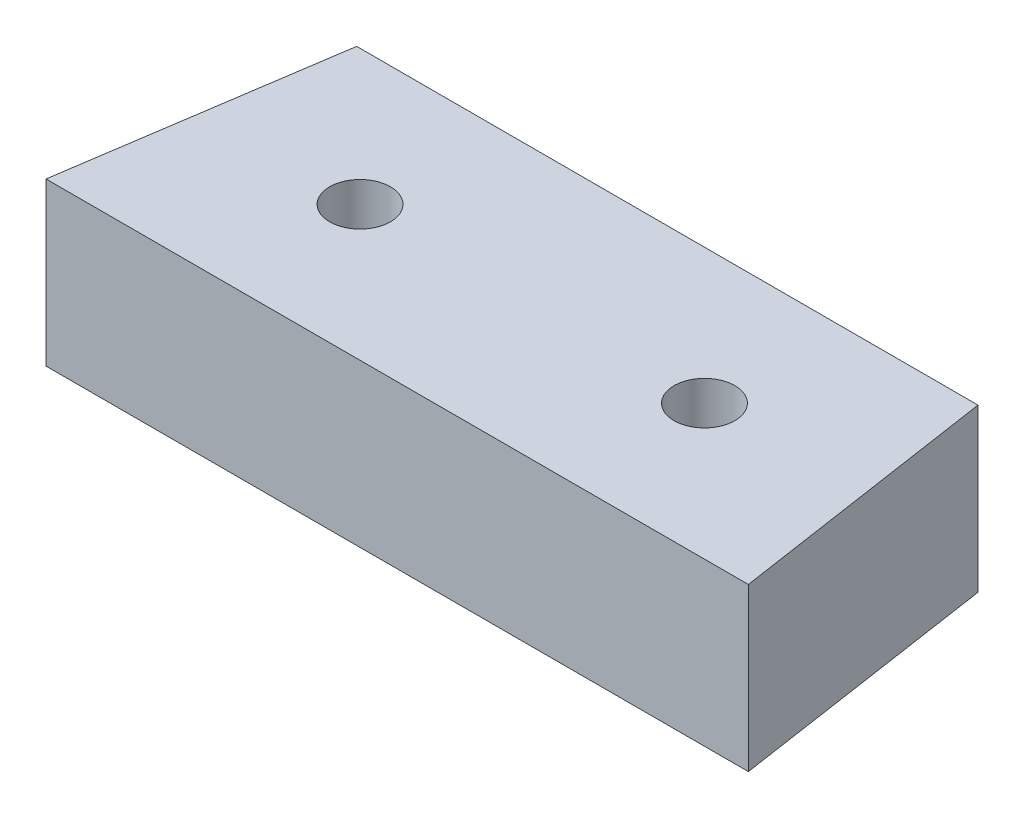
ISO-10303-21;
HEADER;
FILE_DESCRIPTION(('STEP AP214'),'2;1');
FILE_NAME('part.step','',(''),(''),'','','');
FILE_SCHEMA(('AUTOMOTIVE_DESIGN { 1 0 10303 214 1 1 1 1 }'));
ENDSEC;
DATA;
#1=APPLICATION_CONTEXT('core data for automotive mechanical design processes');
#2=APPLICATION_PROTOCOL_DEFINITION('international standard','automotive_design',2000,#1);
#3=PRODUCT_CONTEXT('',#1,'mechanical');
#4=PRODUCT('Part','Part','',(#3));
#5=PRODUCT_RELATED_PRODUCT_CATEGORY('part','',(#4));
#6=PRODUCT_DEFINITION_FORMATION('','',#4);
#7=PRODUCT_DEFINITION_CONTEXT('part definition',#1,'design');
#8=PRODUCT_DEFINITION('design','',#6,#7);
#9=PRODUCT_DEFINITION_SHAPE('','',#8);
#10=(LENGTH_UNIT() NAMED_UNIT(*) SI_UNIT(.MILLI.,.METRE.));
#11=(NAMED_UNIT(*) PLANE_ANGLE_UNIT() SI_UNIT($,.RADIAN.));
#12=(NAMED_UNIT(*) SI_UNIT($,.STERADIAN.) SOLID_ANGLE_UNIT());
#13=UNCERTAINTY_MEASURE_WITH_UNIT(LENGTH_MEASURE(1.E-05),#10,'distance_accuracy_value','');
#14=(GEOMETRIC_REPRESENTATION_CONTEXT(3) GLOBAL_UNCERTAINTY_ASSIGNED_CONTEXT((#13)) GLOBAL_UNIT_ASSIGNED_CONTEXT((#10,
#11,#12)) REPRESENTATION_CONTEXT('',''));
#15=CARTESIAN_POINT('',(0.,0.,0.));
#16=DIRECTION('',(0.,0.,1.));
#17=DIRECTION('',(1.,0.,0.));
#18=AXIS2_PLACEMENT_3D('',#15,#16,#17);
#19=CARTESIAN_POINT('',(0.,12.,0.));
#20=DIRECTION('',(0.,1.,0.));
#21=DIRECTION('',(0.,0.,1.));
#22=AXIS2_PLACEMENT_3D('',#19,#20,#21);
#23=PLANE('',#22);
#24=CARTESIAN_POINT('',(-12.75,12.,0.));
#25=DIRECTION('',(0.,1.,0.));
#26=DIRECTION('',(0.,0.,1.));
#27=AXIS2_PLACEMENT_3D('',#24,#25,#26);
#28=CIRCLE('',#27,2.25);
#29=CARTESIAN_POINT('',(-12.75,12.,2.25));
#30=VERTEX_POINT('',#29);
#31=EDGE_CURVE('E112',#30,#30,#28,.T.);
#32=ORIENTED_EDGE('',*,*,#31,.F.);
#33=EDGE_LOOP('',(#32));
#34=FACE_BOUND('',#33,.T.);
#35=DIRECTION('',(-1.,0.,0.));
#36=VECTOR('',#35,1.);
#37=CARTESIAN_POINT('',(23.,12.,-10.));
#38=LINE('',#37,#36);
#39=CARTESIAN_POINT('',(23.,12.,-10.));
#40=VERTEX_POINT('',#39);
#41=CARTESIAN_POINT('',(-23.,12.,-10.));
#42=VERTEX_POINT('',#41);
#43=EDGE_CURVE('E92',#40,#42,#38,.T.);
#44=ORIENTED_EDGE('',*,*,#43,.T.);
#45=DIRECTION('',(-0.148340452930244,0.,0.988936352868298));
#46=VECTOR('',#45,1.);
#47=CARTESIAN_POINT('',(-23.,12.,-10.));
#48=LINE('',#47,#46);
#49=CARTESIAN_POINT('',(-26.,12.,10.));
#50=VERTEX_POINT('',#49);
#51=EDGE_CURVE('E87',#42,#50,#48,.T.);
#52=ORIENTED_EDGE('',*,*,#51,.T.);
#53=DIRECTION('',(1.,0.,0.));
#54=VECTOR('',#53,1.);
#55=CARTESIAN_POINT('',(-26.,12.,10.));
#56=LINE('',#55,#54);
#57=CARTESIAN_POINT('',(26.,12.,10.));
#58=VERTEX_POINT('',#57);
#59=EDGE_CURVE('E90',#50,#58,#56,.T.);
#60=ORIENTED_EDGE('',*,*,#59,.T.);
#61=DIRECTION('',(-0.148340452930245,0.,-0.988936352868298));
#62=VECTOR('',#61,1.);
#63=CARTESIAN_POINT('',(26.,12.,10.));
#64=LINE('',#63,#62);
#65=EDGE_CURVE('E57',#58,#40,#64,.T.);
#66=ORIENTED_EDGE('',*,*,#65,.T.);
#67=EDGE_LOOP('',(#44,#52,#60,#66));
#68=FACE_BOUND('',#67,.T.);
#69=CARTESIAN_POINT('',(12.75,12.,0.));
#70=DIRECTION('',(0.,1.,0.));
#71=DIRECTION('',(0.,0.,1.));
#72=AXIS2_PLACEMENT_3D('',#69,#70,#71);
#73=CIRCLE('',#72,2.25);
#74=CARTESIAN_POINT('',(12.75,12.,2.24999999999999));
#75=VERTEX_POINT('',#74);
#76=EDGE_CURVE('E134',#75,#75,#73,.T.);
#77=ORIENTED_EDGE('',*,*,#76,.F.);
#78=EDGE_LOOP('',(#77));
#79=FACE_BOUND('',#78,.T.);
#80=ADVANCED_FACE('F39',(#34,#68,#79),#23,.T.);
#81=CARTESIAN_POINT('',(0.,0.,0.));
#82=DIRECTION('',(0.,1.,0.));
#83=DIRECTION('',(0.,0.,1.));
#84=AXIS2_PLACEMENT_3D('',#81,#82,#83);
#85=PLANE('',#84);
#86=DIRECTION('',(-1.,0.,0.));
#87=VECTOR('',#86,1.);
#88=CARTESIAN_POINT('',(23.,0.,-10.));
#89=LINE('',#88,#87);
#90=CARTESIAN_POINT('',(23.,0.,-10.));
#91=VERTEX_POINT('',#90);
#92=CARTESIAN_POINT('',(-23.,0.,-10.));
#93=VERTEX_POINT('',#92);
#94=EDGE_CURVE('E108',#91,#93,#89,.T.);
#95=ORIENTED_EDGE('',*,*,#94,.F.);
#96=DIRECTION('',(-0.148340452930245,0.,-0.988936352868298));
#97=VECTOR('',#96,1.);
#98=CARTESIAN_POINT('',(26.,0.,10.));
#99=LINE('',#98,#97);
#100=CARTESIAN_POINT('',(26.,0.,10.));
#101=VERTEX_POINT('',#100);
#102=EDGE_CURVE('E80',#101,#91,#99,.T.);
#103=ORIENTED_EDGE('',*,*,#102,.F.);
#104=DIRECTION('',(1.,0.,0.));
#105=VECTOR('',#104,1.);
#106=CARTESIAN_POINT('',(-26.,0.,10.));
#107=LINE('',#106,#105);
#108=CARTESIAN_POINT('',(-26.,0.,10.));
#109=VERTEX_POINT('',#108);
#110=EDGE_CURVE('E74',#109,#101,#107,.T.);
#111=ORIENTED_EDGE('',*,*,#110,.F.);
#112=DIRECTION('',(-0.148340452930244,0.,0.988936352868298));
#113=VECTOR('',#112,1.);
#114=CARTESIAN_POINT('',(-23.,0.,-10.));
#115=LINE('',#114,#113);
#116=EDGE_CURVE('E97',#93,#109,#115,.T.);
#117=ORIENTED_EDGE('',*,*,#116,.F.);
#118=EDGE_LOOP('',(#95,#103,#111,#117));
#119=FACE_BOUND('',#118,.T.);
#120=CARTESIAN_POINT('',(-12.75,0.,0.));
#121=DIRECTION('',(0.,1.,0.));
#122=DIRECTION('',(0.,0.,1.));
#123=AXIS2_PLACEMENT_3D('',#120,#121,#122);
#124=CIRCLE('',#123,2.25);
#125=CARTESIAN_POINT('',(-12.75,0.,2.25));
#126=VERTEX_POINT('',#125);
#127=EDGE_CURVE('E130',#126,#126,#124,.T.);
#128=ORIENTED_EDGE('',*,*,#127,.T.);
#129=EDGE_LOOP('',(#128));
#130=FACE_BOUND('',#129,.T.);
#131=CARTESIAN_POINT('',(12.75,0.,0.));
#132=DIRECTION('',(0.,1.,0.));
#133=DIRECTION('',(0.,0.,1.));
#134=AXIS2_PLACEMENT_3D('',#131,#132,#133);
#135=CIRCLE('',#134,2.25);
#136=CARTESIAN_POINT('',(12.75,0.,2.24999999999999));
#137=VERTEX_POINT('',#136);
#138=EDGE_CURVE('E138',#137,#137,#135,.T.);
#139=ORIENTED_EDGE('',*,*,#138,.T.);
#140=EDGE_LOOP('',(#139));
#141=FACE_BOUND('',#140,.T.);
#142=ADVANCED_FACE('F125',(#119,#130,#141),#85,.F.);
#143=CARTESIAN_POINT('',(23.,12.,-10.));
#144=DIRECTION('',(0.,0.,1.));
#145=DIRECTION('',(1.,0.,0.));
#146=AXIS2_PLACEMENT_3D('',#143,#144,#145);
#147=PLANE('',#146);
#148=ORIENTED_EDGE('',*,*,#94,.T.);
#149=DIRECTION('',(0.,-1.,0.));
#150=VECTOR('',#149,1.);
#151=CARTESIAN_POINT('',(-23.,12.,-10.));
#152=LINE('',#151,#150);
#153=EDGE_CURVE('E11',#42,#93,#152,.T.);
#154=ORIENTED_EDGE('',*,*,#153,.F.);
#155=ORIENTED_EDGE('',*,*,#43,.F.);
#156=DIRECTION('',(0.,-1.,0.));
#157=VECTOR('',#156,1.);
#158=CARTESIAN_POINT('',(23.,12.,-10.));
#159=LINE('',#158,#157);
#160=EDGE_CURVE('E104',#40,#91,#159,.T.);
#161=ORIENTED_EDGE('',*,*,#160,.T.);
#162=EDGE_LOOP('',(#148,#154,#155,#161));
#163=FACE_BOUND('',#162,.T.);
#164=ADVANCED_FACE('F41',(#163),#147,.F.);
#165=CARTESIAN_POINT('',(-23.,12.,-10.));
#166=DIRECTION('',(0.988936352868298,0.,0.148340452930244));
#167=DIRECTION('',(0.148340452930244,0.,-0.988936352868298));
#168=AXIS2_PLACEMENT_3D('',#165,#166,#167);
#169=PLANE('',#168);
#170=ORIENTED_EDGE('',*,*,#116,.T.);
#171=DIRECTION('',(0.,-1.,0.));
#172=VECTOR('',#171,1.);
#173=CARTESIAN_POINT('',(-26.,12.,10.));
#174=LINE('',#173,#172);
#175=EDGE_CURVE('E49',#50,#109,#174,.T.);
#176=ORIENTED_EDGE('',*,*,#175,.F.);
#177=ORIENTED_EDGE('',*,*,#51,.F.);
#178=ORIENTED_EDGE('',*,*,#153,.T.);
#179=EDGE_LOOP('',(#170,#176,#177,#178));
#180=FACE_BOUND('',#179,.T.);
#181=ADVANCED_FACE('F96',(#180),#169,.F.);
#182=CARTESIAN_POINT('',(-26.,12.,10.));
#183=DIRECTION('',(0.,0.,-1.));
#184=DIRECTION('',(-1.,0.,0.));
#185=AXIS2_PLACEMENT_3D('',#182,#183,#184);
#186=PLANE('',#185);
#187=ORIENTED_EDGE('',*,*,#110,.T.);
#188=DIRECTION('',(0.,-1.,0.));
#189=VECTOR('',#188,1.);
#190=CARTESIAN_POINT('',(26.,12.,10.));
#191=LINE('',#190,#189);
#192=EDGE_CURVE('E99',#58,#101,#191,.T.);
#193=ORIENTED_EDGE('',*,*,#192,.F.);
#194=ORIENTED_EDGE('',*,*,#59,.F.);
#195=ORIENTED_EDGE('',*,*,#175,.T.);
#196=EDGE_LOOP('',(#187,#193,#194,#195));
#197=FACE_BOUND('',#196,.T.);
#198=ADVANCED_FACE('F100',(#197),#186,.F.);
#199=CARTESIAN_POINT('',(26.,12.,10.));
#200=DIRECTION('',(-0.988936352868297,0.,0.148340452930245));
#201=DIRECTION('',(0.148340452930245,0.,0.988936352868298));
#202=AXIS2_PLACEMENT_3D('',#199,#200,#201);
#203=PLANE('',#202);
#204=ORIENTED_EDGE('',*,*,#102,.T.);
#205=ORIENTED_EDGE('',*,*,#160,.F.);
#206=ORIENTED_EDGE('',*,*,#65,.F.);
#207=ORIENTED_EDGE('',*,*,#192,.T.);
#208=EDGE_LOOP('',(#204,#205,#206,#207));
#209=FACE_BOUND('',#208,.T.);
#210=ADVANCED_FACE('F122',(#209),#203,.F.);
#211=CARTESIAN_POINT('',(-12.75,12.,0.));
#212=DIRECTION('',(0.,-1.,0.));
#213=DIRECTION('',(0.,0.,-1.));
#214=AXIS2_PLACEMENT_3D('',#211,#212,#213);
#215=CYLINDRICAL_SURFACE('',#214,2.25);
#216=ORIENTED_EDGE('',*,*,#31,.T.);
#217=EDGE_LOOP('',(#216));
#218=FACE_BOUND('',#217,.T.);
#219=ORIENTED_EDGE('',*,*,#127,.F.);
#220=EDGE_LOOP('',(#219));
#221=FACE_BOUND('',#220,.T.);
#222=ADVANCED_FACE('F157',(#218,#221),#215,.F.);
#223=CARTESIAN_POINT('',(12.75,12.,0.));
#224=DIRECTION('',(0.,-1.,0.));
#225=DIRECTION('',(0.,0.,-1.));
#226=AXIS2_PLACEMENT_3D('',#223,#224,#225);
#227=CYLINDRICAL_SURFACE('',#226,2.25);
#228=ORIENTED_EDGE('',*,*,#76,.T.);
#229=EDGE_LOOP('',(#228));
#230=FACE_BOUND('',#229,.T.);
#231=ORIENTED_EDGE('',*,*,#138,.F.);
#232=EDGE_LOOP('',(#231));
#233=FACE_BOUND('',#232,.T.);
#234=ADVANCED_FACE('F146',(#230,#233),#227,.F.);
#235=CLOSED_SHELL('',(#80,#142,#164,#181,#198,#210,#222,#234));
#236=MANIFOLD_SOLID_BREP('B2',#235);
#237=ADVANCED_BREP_SHAPE_REPRESENTATION('',(#18,#236),#14);
#238=SHAPE_DEFINITION_REPRESENTATION(#9,#237);
ENDSEC;
END-ISO-10303-21;
